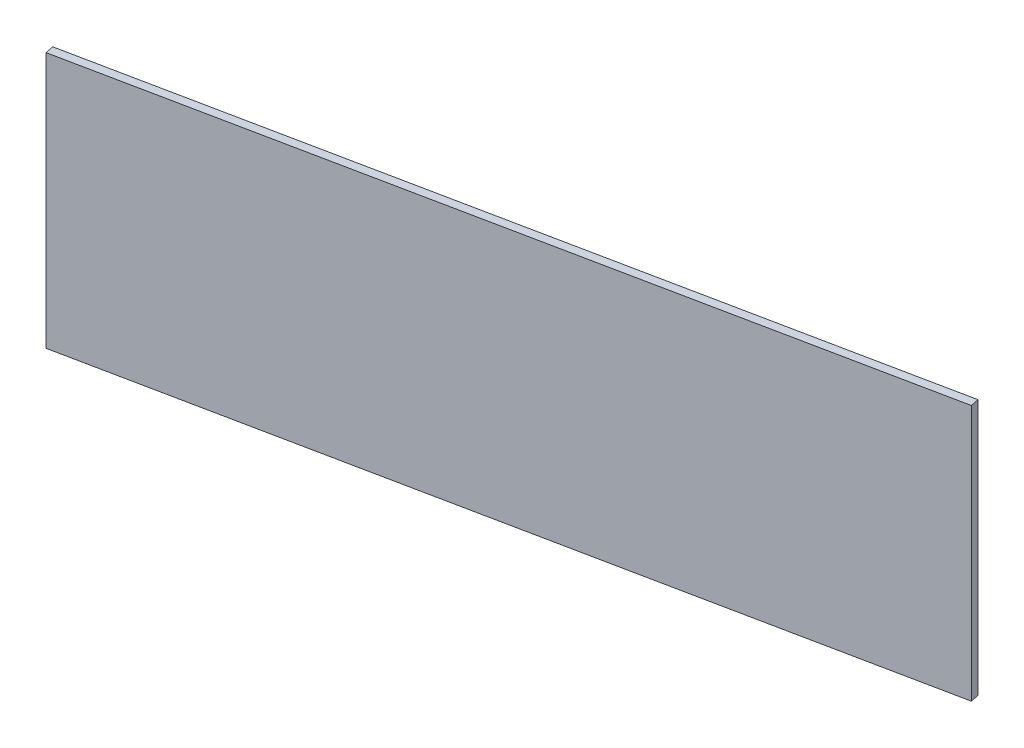
ISO-10303-21;
HEADER;
FILE_DESCRIPTION(('STEP AP214'),'2;1');
FILE_NAME('part.step','',(''),(''),'','','');
FILE_SCHEMA(('AUTOMOTIVE_DESIGN { 1 0 10303 214 1 1 1 1 }'));
ENDSEC;
DATA;
#1=APPLICATION_CONTEXT('core data for automotive mechanical design processes');
#2=APPLICATION_PROTOCOL_DEFINITION('international standard','automotive_design',2000,#1);
#3=PRODUCT_CONTEXT('',#1,'mechanical');
#4=PRODUCT('Part','Part','',(#3));
#5=PRODUCT_RELATED_PRODUCT_CATEGORY('part','',(#4));
#6=PRODUCT_DEFINITION_FORMATION('','',#4);
#7=PRODUCT_DEFINITION_CONTEXT('part definition',#1,'design');
#8=PRODUCT_DEFINITION('design','',#6,#7);
#9=PRODUCT_DEFINITION_SHAPE('','',#8);
#10=(LENGTH_UNIT() NAMED_UNIT(*) SI_UNIT(.MILLI.,.METRE.));
#11=(NAMED_UNIT(*) PLANE_ANGLE_UNIT() SI_UNIT($,.RADIAN.));
#12=(NAMED_UNIT(*) SI_UNIT($,.STERADIAN.) SOLID_ANGLE_UNIT());
#13=UNCERTAINTY_MEASURE_WITH_UNIT(LENGTH_MEASURE(1.E-05),#10,'distance_accuracy_value','');
#14=(GEOMETRIC_REPRESENTATION_CONTEXT(3) GLOBAL_UNCERTAINTY_ASSIGNED_CONTEXT((#13)) GLOBAL_UNIT_ASSIGNED_CONTEXT((#10,
#11,#12)) REPRESENTATION_CONTEXT('',''));
#15=CARTESIAN_POINT('',(0.,0.,0.));
#16=DIRECTION('',(0.,0.,1.));
#17=DIRECTION('',(1.,0.,0.));
#18=AXIS2_PLACEMENT_3D('',#15,#16,#17);
#19=CARTESIAN_POINT('',(-0.320199529269977,0.,-1.5663814810234));
#20=DIRECTION('',(-0.200278154070655,0.,-0.979739078021312));
#21=DIRECTION('',(0.979739078021312,0.,-0.200278154070655));
#22=AXIS2_PLACEMENT_3D('',#19,#20,#21);
#23=PLANE('',#22);
#24=DIRECTION('',(0.,1.,0.));
#25=VECTOR('',#24,1.);
#26=CARTESIAN_POINT('',(-0.602002781540707,-0.01,-1.5087752913327));
#27=LINE('',#26,#25);
#28=CARTESIAN_POINT('',(-0.602002781540707,-0.01,-1.5087752913327));
#29=VERTEX_POINT('',#28);
#30=CARTESIAN_POINT('',(-0.602002781540707,0.29,-1.5087752913327));
#31=VERTEX_POINT('',#30);
#32=EDGE_CURVE('E11',#29,#31,#27,.T.);
#33=ORIENTED_EDGE('',*,*,#32,.F.);
#34=DIRECTION('',(0.979739078021312,0.,-0.200278154070655));
#35=VECTOR('',#34,1.);
#36=CARTESIAN_POINT('',(-1.50200278154071,-0.0100000000000001,-1.32479739078021));
#37=LINE('',#36,#35);
#38=CARTESIAN_POINT('',(-1.50200278154071,-0.0100000000000001,-1.32479739078021));
#39=VERTEX_POINT('',#38);
#40=EDGE_CURVE('E75',#39,#29,#37,.T.);
#41=ORIENTED_EDGE('',*,*,#40,.F.);
#42=DIRECTION('',(0.,-1.,0.));
#43=VECTOR('',#42,1.);
#44=CARTESIAN_POINT('',(-1.50200278154071,0.29,-1.32479739078021));
#45=LINE('',#44,#43);
#46=CARTESIAN_POINT('',(-1.50200278154071,0.29,-1.32479739078021));
#47=VERTEX_POINT('',#46);
#48=EDGE_CURVE('E72',#47,#39,#45,.T.);
#49=ORIENTED_EDGE('',*,*,#48,.F.);
#50=DIRECTION('',(-0.979739078021312,0.,0.200278154070655));
#51=VECTOR('',#50,1.);
#52=CARTESIAN_POINT('',(-0.602002781540707,0.29,-1.5087752913327));
#53=LINE('',#52,#51);
#54=EDGE_CURVE('E65',#31,#47,#53,.T.);
#55=ORIENTED_EDGE('',*,*,#54,.F.);
#56=EDGE_LOOP('',(#33,#41,#49,#55));
#57=FACE_BOUND('',#56,.T.);
#58=ADVANCED_FACE('F17',(#57),#23,.T.);
#59=CARTESIAN_POINT('',(-0.602002781540707,0.29,-1.5087752913327));
#60=DIRECTION('',(0.,1.,0.));
#61=DIRECTION('',(-1.,0.,0.));
#62=AXIS2_PLACEMENT_3D('',#59,#60,#61);
#63=PLANE('',#62);
#64=DIRECTION('',(-0.979739078021194,-1.20798335344779E-13,0.200278154071234));
#65=VECTOR('',#64,1.);
#66=CARTESIAN_POINT('',(-0.600000000000109,0.290000000000111,-1.49897790055302));
#67=LINE('',#66,#65);
#68=CARTESIAN_POINT('',(-0.600000000000109,0.290000000000111,-1.49897790055302));
#69=VERTEX_POINT('',#68);
#70=CARTESIAN_POINT('',(-1.5,0.29,-1.315));
#71=VERTEX_POINT('',#70);
#72=EDGE_CURVE('E24',#69,#71,#67,.T.);
#73=ORIENTED_EDGE('',*,*,#72,.F.);
#74=DIRECTION('',(0.200278154070652,0.,0.979739078021313));
#75=VECTOR('',#74,1.);
#76=CARTESIAN_POINT('',(-0.602002781540707,0.29,-1.5087752913327));
#77=LINE('',#76,#75);
#78=EDGE_CURVE('E76',#31,#69,#77,.T.);
#79=ORIENTED_EDGE('',*,*,#78,.F.);
#80=ORIENTED_EDGE('',*,*,#54,.T.);
#81=DIRECTION('',(0.200278154070649,0.,0.979739078021313));
#82=VECTOR('',#81,1.);
#83=CARTESIAN_POINT('',(-1.50200278154071,0.29,-1.32479739078021));
#84=LINE('',#83,#82);
#85=EDGE_CURVE('E85',#47,#71,#84,.T.);
#86=ORIENTED_EDGE('',*,*,#85,.T.);
#87=EDGE_LOOP('',(#73,#79,#80,#86));
#88=FACE_BOUND('',#87,.T.);
#89=ADVANCED_FACE('F89',(#88),#63,.T.);
#90=CARTESIAN_POINT('',(-1.50200278154071,-0.0100000000000001,-1.32479739078021));
#91=DIRECTION('',(-0.979739078021312,0.,0.200278154070655));
#92=DIRECTION('',(0.200278154070655,0.,0.979739078021312));
#93=AXIS2_PLACEMENT_3D('',#90,#91,#92);
#94=PLANE('',#93);
#95=DIRECTION('',(0.,-1.,0.));
#96=VECTOR('',#95,1.);
#97=CARTESIAN_POINT('',(-1.5,0.29,-1.315));
#98=LINE('',#97,#96);
#99=CARTESIAN_POINT('',(-1.5,-0.0100000000000001,-1.315));
#100=VERTEX_POINT('',#99);
#101=EDGE_CURVE('E71',#71,#100,#98,.T.);
#102=ORIENTED_EDGE('',*,*,#101,.F.);
#103=ORIENTED_EDGE('',*,*,#85,.F.);
#104=ORIENTED_EDGE('',*,*,#48,.T.);
#105=DIRECTION('',(0.200278154070649,0.,0.979739078021313));
#106=VECTOR('',#105,1.);
#107=CARTESIAN_POINT('',(-1.50200278154071,-0.0100000000000001,-1.32479739078021));
#108=LINE('',#107,#106);
#109=EDGE_CURVE('E61',#39,#100,#108,.T.);
#110=ORIENTED_EDGE('',*,*,#109,.T.);
#111=EDGE_LOOP('',(#102,#103,#104,#110));
#112=FACE_BOUND('',#111,.T.);
#113=ADVANCED_FACE('F69',(#112),#94,.T.);
#114=CARTESIAN_POINT('',(-0.602002781540707,-0.01,-1.5087752913327));
#115=DIRECTION('',(0.979739078021312,0.,-0.200278154070655));
#116=DIRECTION('',(-0.200278154070655,0.,-0.979739078021312));
#117=AXIS2_PLACEMENT_3D('',#114,#115,#116);
#118=PLANE('',#117);
#119=DIRECTION('',(0.,1.,0.));
#120=VECTOR('',#119,1.);
#121=CARTESIAN_POINT('',(-0.600000000000001,-0.01,-1.49897790055249));
#122=LINE('',#121,#120);
#123=CARTESIAN_POINT('',(-0.600000000000001,-0.01,-1.49897790055249));
#124=VERTEX_POINT('',#123);
#125=EDGE_CURVE('E83',#124,#69,#122,.T.);
#126=ORIENTED_EDGE('',*,*,#125,.F.);
#127=DIRECTION('',(0.200278154070647,0.,0.979739078021314));
#128=VECTOR('',#127,1.);
#129=CARTESIAN_POINT('',(-0.602002781540707,-0.01,-1.5087752913327));
#130=LINE('',#129,#128);
#131=EDGE_CURVE('E62',#29,#124,#130,.T.);
#132=ORIENTED_EDGE('',*,*,#131,.F.);
#133=ORIENTED_EDGE('',*,*,#32,.T.);
#134=ORIENTED_EDGE('',*,*,#78,.T.);
#135=EDGE_LOOP('',(#126,#132,#133,#134));
#136=FACE_BOUND('',#135,.T.);
#137=ADVANCED_FACE('F91',(#136),#118,.T.);
#138=CARTESIAN_POINT('',(0.,-0.01,0.));
#139=DIRECTION('',(0.,-1.,0.));
#140=DIRECTION('',(0.,0.,-1.));
#141=AXIS2_PLACEMENT_3D('',#138,#139,#140);
#142=PLANE('',#141);
#143=DIRECTION('',(0.979739078021194,0.,-0.200278154071234));
#144=VECTOR('',#143,1.);
#145=CARTESIAN_POINT('',(-1.5,-0.01,-1.315));
#146=LINE('',#145,#144);
#147=EDGE_CURVE('E57',#100,#124,#146,.T.);
#148=ORIENTED_EDGE('',*,*,#147,.F.);
#149=ORIENTED_EDGE('',*,*,#109,.F.);
#150=ORIENTED_EDGE('',*,*,#40,.T.);
#151=ORIENTED_EDGE('',*,*,#131,.T.);
#152=EDGE_LOOP('',(#148,#149,#150,#151));
#153=FACE_BOUND('',#152,.T.);
#154=ADVANCED_FACE('F59',(#153),#142,.T.);
#155=CARTESIAN_POINT('',(-0.600000000000109,0.29,-1.49897790055302));
#156=DIRECTION('',(0.200278154071234,0.,0.979739078021194));
#157=DIRECTION('',(-0.979739078021194,0.,0.200278154071234));
#158=AXIS2_PLACEMENT_3D('',#155,#156,#157);
#159=PLANE('',#158);
#160=ORIENTED_EDGE('',*,*,#147,.T.);
#161=ORIENTED_EDGE('',*,*,#125,.T.);
#162=ORIENTED_EDGE('',*,*,#72,.T.);
#163=ORIENTED_EDGE('',*,*,#101,.T.);
#164=EDGE_LOOP('',(#160,#161,#162,#163));
#165=FACE_BOUND('',#164,.T.);
#166=ADVANCED_FACE('F74',(#165),#159,.T.);
#167=CLOSED_SHELL('',(#58,#89,#113,#137,#154,#166));
#168=MANIFOLD_SOLID_BREP('B1',#167);
#169=ADVANCED_BREP_SHAPE_REPRESENTATION('',(#18,#168),#14);
#170=SHAPE_DEFINITION_REPRESENTATION(#9,#169);
ENDSEC;
END-ISO-10303-21;
